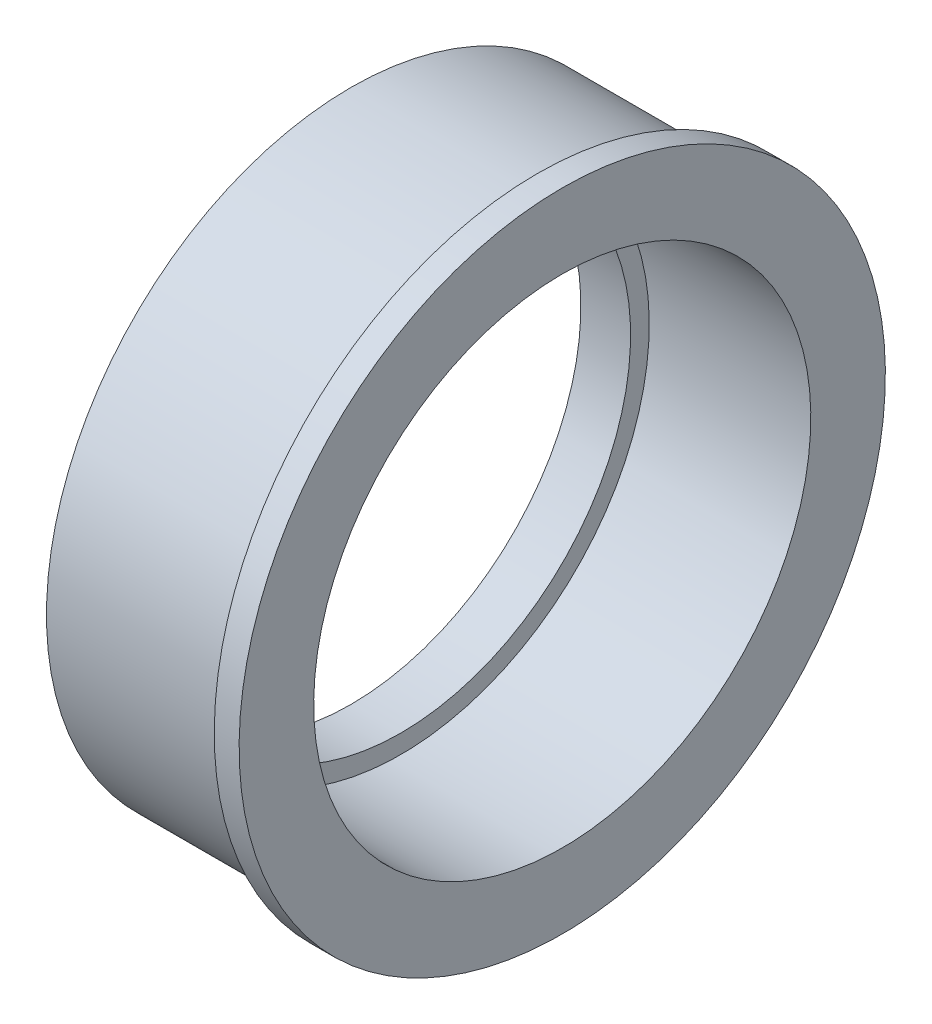
ISO-10303-21;
HEADER;
FILE_DESCRIPTION(('STEP AP214'),'2;1');
FILE_NAME('part.step','',(''),(''),'','','');
FILE_SCHEMA(('AUTOMOTIVE_DESIGN { 1 0 10303 214 1 1 1 1 }'));
ENDSEC;
DATA;
#1=APPLICATION_CONTEXT('core data for automotive mechanical design processes');
#2=APPLICATION_PROTOCOL_DEFINITION('international standard','automotive_design',2000,#1);
#3=PRODUCT_CONTEXT('',#1,'mechanical');
#4=PRODUCT('Part','Part','',(#3));
#5=PRODUCT_RELATED_PRODUCT_CATEGORY('part','',(#4));
#6=PRODUCT_DEFINITION_FORMATION('','',#4);
#7=PRODUCT_DEFINITION_CONTEXT('part definition',#1,'design');
#8=PRODUCT_DEFINITION('design','',#6,#7);
#9=PRODUCT_DEFINITION_SHAPE('','',#8);
#10=(LENGTH_UNIT() NAMED_UNIT(*) SI_UNIT(.MILLI.,.METRE.));
#11=(NAMED_UNIT(*) PLANE_ANGLE_UNIT() SI_UNIT($,.RADIAN.));
#12=(NAMED_UNIT(*) SI_UNIT($,.STERADIAN.) SOLID_ANGLE_UNIT());
#13=UNCERTAINTY_MEASURE_WITH_UNIT(LENGTH_MEASURE(1.E-05),#10,'distance_accuracy_value','');
#14=(GEOMETRIC_REPRESENTATION_CONTEXT(3) GLOBAL_UNCERTAINTY_ASSIGNED_CONTEXT((#13)) GLOBAL_UNIT_ASSIGNED_CONTEXT((#10,
#11,#12)) REPRESENTATION_CONTEXT('',''));
#15=CARTESIAN_POINT('',(0.,0.,0.));
#16=DIRECTION('',(0.,0.,1.));
#17=DIRECTION('',(1.,0.,0.));
#18=AXIS2_PLACEMENT_3D('',#15,#16,#17);
#19=CARTESIAN_POINT('',(81.2775291828794,0.,0.));
#20=DIRECTION('',(1.,0.,0.));
#21=DIRECTION('',(0.,1.,0.));
#22=AXIS2_PLACEMENT_3D('',#19,#20,#21);
#23=CYLINDRICAL_SURFACE('',#22,20.);
#24=CARTESIAN_POINT('',(17.,0.,0.));
#25=DIRECTION('',(1.,0.,0.));
#26=DIRECTION('',(0.,1.,0.));
#27=AXIS2_PLACEMENT_3D('',#24,#25,#26);
#28=CIRCLE('',#27,20.);
#29=CARTESIAN_POINT('',(17.,20.,0.));
#30=VERTEX_POINT('',#29);
#31=EDGE_CURVE('E10',#30,#30,#28,.T.);
#32=ORIENTED_EDGE('',*,*,#31,.T.);
#33=EDGE_LOOP('',(#32));
#34=FACE_BOUND('',#33,.T.);
#35=CARTESIAN_POINT('',(4.,0.,0.));
#36=DIRECTION('',(1.,0.,0.));
#37=DIRECTION('',(0.,1.,0.));
#38=AXIS2_PLACEMENT_3D('',#35,#36,#37);
#39=CIRCLE('',#38,20.);
#40=CARTESIAN_POINT('',(4.,20.,0.));
#41=VERTEX_POINT('',#40);
#42=EDGE_CURVE('E35',#41,#41,#39,.T.);
#43=ORIENTED_EDGE('',*,*,#42,.F.);
#44=EDGE_LOOP('',(#43));
#45=FACE_BOUND('',#44,.T.);
#46=ADVANCED_FACE('F29',(#34,#45),#23,.F.);
#47=CARTESIAN_POINT('',(4.,20.,0.));
#48=DIRECTION('',(1.,0.,0.));
#49=DIRECTION('',(0.,1.,0.));
#50=AXIS2_PLACEMENT_3D('',#47,#48,#49);
#51=PLANE('',#50);
#52=ORIENTED_EDGE('',*,*,#42,.T.);
#53=EDGE_LOOP('',(#52));
#54=FACE_BOUND('',#53,.T.);
#55=CARTESIAN_POINT('',(4.,0.,0.));
#56=DIRECTION('',(1.,0.,0.));
#57=DIRECTION('',(0.,1.,0.));
#58=AXIS2_PLACEMENT_3D('',#55,#56,#57);
#59=CIRCLE('',#58,18.5);
#60=CARTESIAN_POINT('',(4.,18.5,0.));
#61=VERTEX_POINT('',#60);
#62=EDGE_CURVE('E39',#61,#61,#59,.T.);
#63=ORIENTED_EDGE('',*,*,#62,.F.);
#64=EDGE_LOOP('',(#63));
#65=FACE_BOUND('',#64,.T.);
#66=ADVANCED_FACE('F78',(#54,#65),#51,.T.);
#67=CARTESIAN_POINT('',(81.2775291828794,0.,0.));
#68=DIRECTION('',(1.,0.,0.));
#69=DIRECTION('',(0.,1.,0.));
#70=AXIS2_PLACEMENT_3D('',#67,#68,#69);
#71=CYLINDRICAL_SURFACE('',#70,18.5);
#72=ORIENTED_EDGE('',*,*,#62,.T.);
#73=EDGE_LOOP('',(#72));
#74=FACE_BOUND('',#73,.T.);
#75=CARTESIAN_POINT('',(0.,0.,0.));
#76=DIRECTION('',(1.,0.,0.));
#77=DIRECTION('',(0.,1.,0.));
#78=AXIS2_PLACEMENT_3D('',#75,#76,#77);
#79=CIRCLE('',#78,18.5);
#80=CARTESIAN_POINT('',(0.,18.5,0.));
#81=VERTEX_POINT('',#80);
#82=EDGE_CURVE('E43',#81,#81,#79,.T.);
#83=ORIENTED_EDGE('',*,*,#82,.F.);
#84=EDGE_LOOP('',(#83));
#85=FACE_BOUND('',#84,.T.);
#86=ADVANCED_FACE('F82',(#74,#85),#71,.F.);
#87=CARTESIAN_POINT('',(0.,24.5,0.));
#88=DIRECTION('',(-1.,0.,0.));
#89=DIRECTION('',(0.,-1.,0.));
#90=AXIS2_PLACEMENT_3D('',#87,#88,#89);
#91=PLANE('',#90);
#92=ORIENTED_EDGE('',*,*,#82,.T.);
#93=EDGE_LOOP('',(#92));
#94=FACE_BOUND('',#93,.T.);
#95=CARTESIAN_POINT('',(0.,0.,0.));
#96=DIRECTION('',(1.,0.,0.));
#97=DIRECTION('',(0.,1.,0.));
#98=AXIS2_PLACEMENT_3D('',#95,#96,#97);
#99=CIRCLE('',#98,24.5);
#100=CARTESIAN_POINT('',(0.,24.5,0.));
#101=VERTEX_POINT('',#100);
#102=EDGE_CURVE('E48',#101,#101,#99,.T.);
#103=ORIENTED_EDGE('',*,*,#102,.F.);
#104=EDGE_LOOP('',(#103));
#105=FACE_BOUND('',#104,.T.);
#106=ADVANCED_FACE('F87',(#94,#105),#91,.T.);
#107=CARTESIAN_POINT('',(81.2775291828794,0.,0.));
#108=DIRECTION('',(1.,0.,0.));
#109=DIRECTION('',(0.,1.,0.));
#110=AXIS2_PLACEMENT_3D('',#107,#108,#109);
#111=CYLINDRICAL_SURFACE('',#110,24.5);
#112=ORIENTED_EDGE('',*,*,#102,.T.);
#113=EDGE_LOOP('',(#112));
#114=FACE_BOUND('',#113,.T.);
#115=CARTESIAN_POINT('',(15.,0.,0.));
#116=DIRECTION('',(1.,0.,0.));
#117=DIRECTION('',(0.,1.,0.));
#118=AXIS2_PLACEMENT_3D('',#115,#116,#117);
#119=CIRCLE('',#118,24.5);
#120=CARTESIAN_POINT('',(15.,24.5,0.));
#121=VERTEX_POINT('',#120);
#122=EDGE_CURVE('E51',#121,#121,#119,.T.);
#123=ORIENTED_EDGE('',*,*,#122,.F.);
#124=EDGE_LOOP('',(#123));
#125=FACE_BOUND('',#124,.T.);
#126=ADVANCED_FACE('F74',(#114,#125),#111,.T.);
#127=CARTESIAN_POINT('',(15.,26.,0.));
#128=DIRECTION('',(-1.,0.,0.));
#129=DIRECTION('',(0.,-1.,0.));
#130=AXIS2_PLACEMENT_3D('',#127,#128,#129);
#131=PLANE('',#130);
#132=ORIENTED_EDGE('',*,*,#122,.T.);
#133=EDGE_LOOP('',(#132));
#134=FACE_BOUND('',#133,.T.);
#135=CARTESIAN_POINT('',(15.,0.,0.));
#136=DIRECTION('',(1.,0.,0.));
#137=DIRECTION('',(0.,1.,0.));
#138=AXIS2_PLACEMENT_3D('',#135,#136,#137);
#139=CIRCLE('',#138,26.);
#140=CARTESIAN_POINT('',(15.,26.,0.));
#141=VERTEX_POINT('',#140);
#142=EDGE_CURVE('E54',#141,#141,#139,.T.);
#143=ORIENTED_EDGE('',*,*,#142,.F.);
#144=EDGE_LOOP('',(#143));
#145=FACE_BOUND('',#144,.T.);
#146=ADVANCED_FACE('F66',(#134,#145),#131,.T.);
#147=CARTESIAN_POINT('',(81.2775291828794,0.,0.));
#148=DIRECTION('',(1.,0.,0.));
#149=DIRECTION('',(0.,1.,0.));
#150=AXIS2_PLACEMENT_3D('',#147,#148,#149);
#151=CYLINDRICAL_SURFACE('',#150,26.);
#152=ORIENTED_EDGE('',*,*,#142,.T.);
#153=EDGE_LOOP('',(#152));
#154=FACE_BOUND('',#153,.T.);
#155=CARTESIAN_POINT('',(17.,0.,0.));
#156=DIRECTION('',(1.,0.,0.));
#157=DIRECTION('',(0.,1.,0.));
#158=AXIS2_PLACEMENT_3D('',#155,#156,#157);
#159=CIRCLE('',#158,26.);
#160=CARTESIAN_POINT('',(17.,26.,0.));
#161=VERTEX_POINT('',#160);
#162=EDGE_CURVE('E57',#161,#161,#159,.T.);
#163=ORIENTED_EDGE('',*,*,#162,.F.);
#164=EDGE_LOOP('',(#163));
#165=FACE_BOUND('',#164,.T.);
#166=ADVANCED_FACE('F64',(#154,#165),#151,.T.);
#167=CARTESIAN_POINT('',(17.,20.0594662902942,0.));
#168=DIRECTION('',(1.,0.,0.));
#169=DIRECTION('',(0.,1.,0.));
#170=AXIS2_PLACEMENT_3D('',#167,#168,#169);
#171=PLANE('',#170);
#172=ORIENTED_EDGE('',*,*,#162,.T.);
#173=EDGE_LOOP('',(#172));
#174=FACE_BOUND('',#173,.T.);
#175=ORIENTED_EDGE('',*,*,#31,.F.);
#176=EDGE_LOOP('',(#175));
#177=FACE_BOUND('',#176,.T.);
#178=ADVANCED_FACE('F61',(#174,#177),#171,.T.);
#179=CLOSED_SHELL('',(#46,#66,#86,#106,#126,#146,#166,#178));
#180=MANIFOLD_SOLID_BREP('B2',#179);
#181=ADVANCED_BREP_SHAPE_REPRESENTATION('',(#18,#180),#14);
#182=SHAPE_DEFINITION_REPRESENTATION(#9,#181);
ENDSEC;
END-ISO-10303-21;
